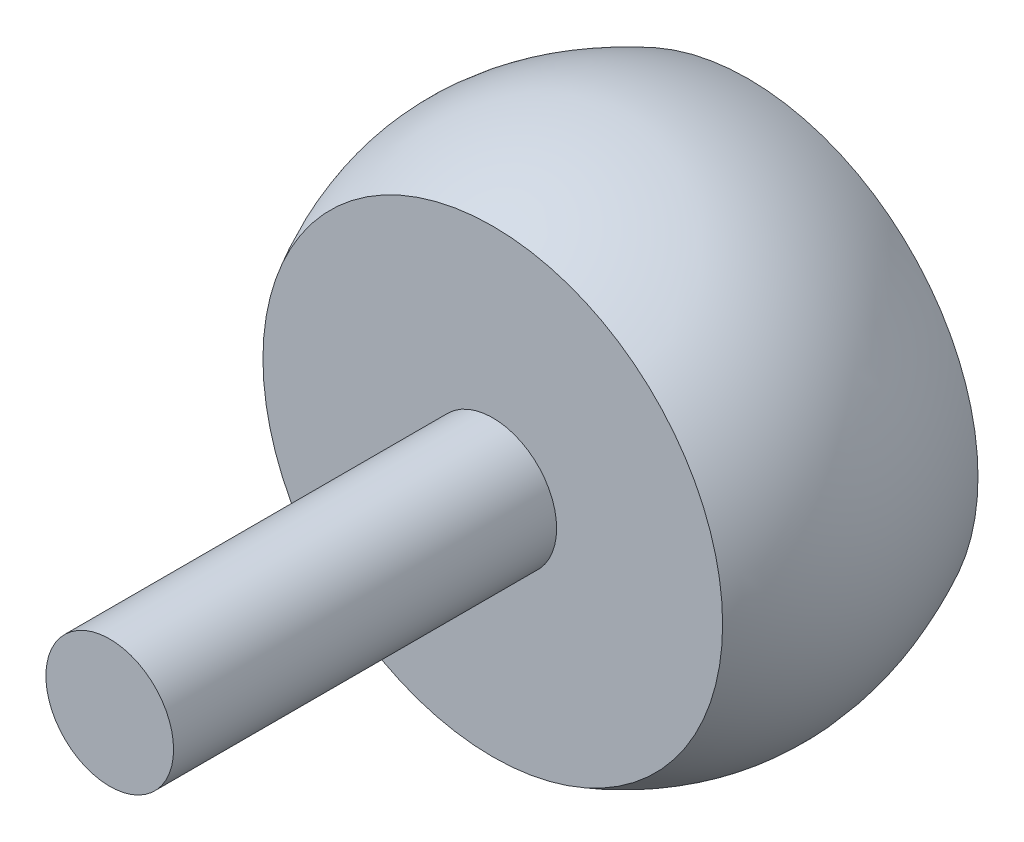
ISO-10303-21;
HEADER;
FILE_DESCRIPTION(('STEP AP214'),'2;1');
FILE_NAME('part.step','',(''),(''),'','','');
FILE_SCHEMA(('AUTOMOTIVE_DESIGN { 1 0 10303 214 1 1 1 1 }'));
ENDSEC;
DATA;
#1=APPLICATION_CONTEXT('core data for automotive mechanical design processes');
#2=APPLICATION_PROTOCOL_DEFINITION('international standard','automotive_design',2000,#1);
#3=PRODUCT_CONTEXT('',#1,'mechanical');
#4=PRODUCT('Part','Part','',(#3));
#5=PRODUCT_RELATED_PRODUCT_CATEGORY('part','',(#4));
#6=PRODUCT_DEFINITION_FORMATION('','',#4);
#7=PRODUCT_DEFINITION_CONTEXT('part definition',#1,'design');
#8=PRODUCT_DEFINITION('design','',#6,#7);
#9=PRODUCT_DEFINITION_SHAPE('','',#8);
#10=(LENGTH_UNIT() NAMED_UNIT(*) SI_UNIT(.MILLI.,.METRE.));
#11=(NAMED_UNIT(*) PLANE_ANGLE_UNIT() SI_UNIT($,.RADIAN.));
#12=(NAMED_UNIT(*) SI_UNIT($,.STERADIAN.) SOLID_ANGLE_UNIT());
#13=UNCERTAINTY_MEASURE_WITH_UNIT(LENGTH_MEASURE(1.E-05),#10,'distance_accuracy_value','');
#14=(GEOMETRIC_REPRESENTATION_CONTEXT(3) GLOBAL_UNCERTAINTY_ASSIGNED_CONTEXT((#13)) GLOBAL_UNIT_ASSIGNED_CONTEXT((#10,
#11,#12)) REPRESENTATION_CONTEXT('',''));
#15=CARTESIAN_POINT('',(0.,0.,0.));
#16=DIRECTION('',(0.,0.,1.));
#17=DIRECTION('',(1.,0.,0.));
#18=AXIS2_PLACEMENT_3D('',#15,#16,#17);
#19=CARTESIAN_POINT('',(0.,0.,10.));
#20=DIRECTION('',(0.,0.,1.));
#21=DIRECTION('',(1.,0.,0.));
#22=AXIS2_PLACEMENT_3D('',#19,#20,#21);
#23=PLANE('',#22);
#24=CARTESIAN_POINT('',(0.,0.,10.));
#25=DIRECTION('',(0.,0.,1.));
#26=DIRECTION('',(1.,0.,0.));
#27=AXIS2_PLACEMENT_3D('',#24,#25,#26);
#28=CIRCLE('',#27,2.5);
#29=CARTESIAN_POINT('',(2.5,0.,10.));
#30=VERTEX_POINT('',#29);
#31=EDGE_CURVE('E10',#30,#30,#28,.T.);
#32=ORIENTED_EDGE('',*,*,#31,.F.);
#33=EDGE_LOOP('',(#32));
#34=FACE_BOUND('',#33,.T.);
#35=CARTESIAN_POINT('',(0.,0.,10.));
#36=DIRECTION('',(0.,0.,1.));
#37=DIRECTION('',(1.,0.,0.));
#38=AXIS2_PLACEMENT_3D('',#35,#36,#37);
#39=CIRCLE('',#38,9.);
#40=CARTESIAN_POINT('',(9.,0.,10.));
#41=VERTEX_POINT('',#40);
#42=EDGE_CURVE('E43',#41,#41,#39,.T.);
#43=ORIENTED_EDGE('',*,*,#42,.T.);
#44=EDGE_LOOP('',(#43));
#45=FACE_BOUND('',#44,.T.);
#46=ADVANCED_FACE('F31',(#34,#45),#23,.T.);
#47=CARTESIAN_POINT('',(0.,9.,0.));
#48=CARTESIAN_POINT('',(0.,10.8776667397986,3.75093178982303));
#49=CARTESIAN_POINT('',(0.,10.6649826454121,7.02529973160023));
#50=CARTESIAN_POINT('',(0.,9.,10.));
#51=B_SPLINE_CURVE_WITH_KNOTS('',3,(#47,#48,#49,#50),.UNSPECIFIED.,.F.,.F.,(4,4),(0.,1.),.UNSPECIFIED.);
#52=CARTESIAN_POINT('',(0.,0.,17.8884988583086));
#53=DIRECTION('',(0.,0.,1.));
#54=AXIS1_PLACEMENT('',#52,#53);
#55=SURFACE_OF_REVOLUTION('',#51,#54);
#56=ORIENTED_EDGE('',*,*,#42,.F.);
#57=EDGE_LOOP('',(#56));
#58=FACE_BOUND('',#57,.T.);
#59=CARTESIAN_POINT('',(0.,0.,0.));
#60=DIRECTION('',(0.,0.,1.));
#61=DIRECTION('',(1.,0.,0.));
#62=AXIS2_PLACEMENT_3D('',#59,#60,#61);
#63=CIRCLE('',#62,9.);
#64=CARTESIAN_POINT('',(9.,0.,0.));
#65=VERTEX_POINT('',#64);
#66=EDGE_CURVE('E35',#65,#65,#63,.T.);
#67=ORIENTED_EDGE('',*,*,#66,.T.);
#68=EDGE_LOOP('',(#67));
#69=FACE_BOUND('',#68,.T.);
#70=ADVANCED_FACE('F54',(#58,#69),#55,.T.);
#71=CARTESIAN_POINT('',(0.,0.,0.));
#72=DIRECTION('',(0.,0.,1.));
#73=DIRECTION('',(1.,0.,0.));
#74=AXIS2_PLACEMENT_3D('',#71,#72,#73);
#75=PLANE('',#74);
#76=ORIENTED_EDGE('',*,*,#66,.F.);
#77=EDGE_LOOP('',(#76));
#78=FACE_BOUND('',#77,.T.);
#79=ADVANCED_FACE('F33',(#78),#75,.F.);
#80=CARTESIAN_POINT('',(0.,0.,25.));
#81=DIRECTION('',(0.,0.,-1.));
#82=DIRECTION('',(-1.,0.,0.));
#83=AXIS2_PLACEMENT_3D('',#80,#81,#82);
#84=CYLINDRICAL_SURFACE('',#83,2.5);
#85=CARTESIAN_POINT('',(0.,0.,25.));
#86=DIRECTION('',(0.,0.,1.));
#87=DIRECTION('',(1.,0.,0.));
#88=AXIS2_PLACEMENT_3D('',#85,#86,#87);
#89=CIRCLE('',#88,2.5);
#90=CARTESIAN_POINT('',(2.5,0.,25.));
#91=VERTEX_POINT('',#90);
#92=EDGE_CURVE('E46',#91,#91,#89,.T.);
#93=ORIENTED_EDGE('',*,*,#92,.F.);
#94=EDGE_LOOP('',(#93));
#95=FACE_BOUND('',#94,.T.);
#96=ORIENTED_EDGE('',*,*,#31,.T.);
#97=EDGE_LOOP('',(#96));
#98=FACE_BOUND('',#97,.T.);
#99=ADVANCED_FACE('F58',(#95,#98),#84,.T.);
#100=CARTESIAN_POINT('',(0.,0.,25.));
#101=DIRECTION('',(0.,0.,1.));
#102=DIRECTION('',(1.,0.,0.));
#103=AXIS2_PLACEMENT_3D('',#100,#101,#102);
#104=PLANE('',#103);
#105=ORIENTED_EDGE('',*,*,#92,.T.);
#106=EDGE_LOOP('',(#105));
#107=FACE_BOUND('',#106,.T.);
#108=ADVANCED_FACE('F70',(#107),#104,.T.);
#109=CLOSED_SHELL('',(#46,#70,#79,#99,#108));
#110=MANIFOLD_SOLID_BREP('B2',#109);
#111=ADVANCED_BREP_SHAPE_REPRESENTATION('',(#18,#110),#14);
#112=SHAPE_DEFINITION_REPRESENTATION(#9,#111);
ENDSEC;
END-ISO-10303-21;
